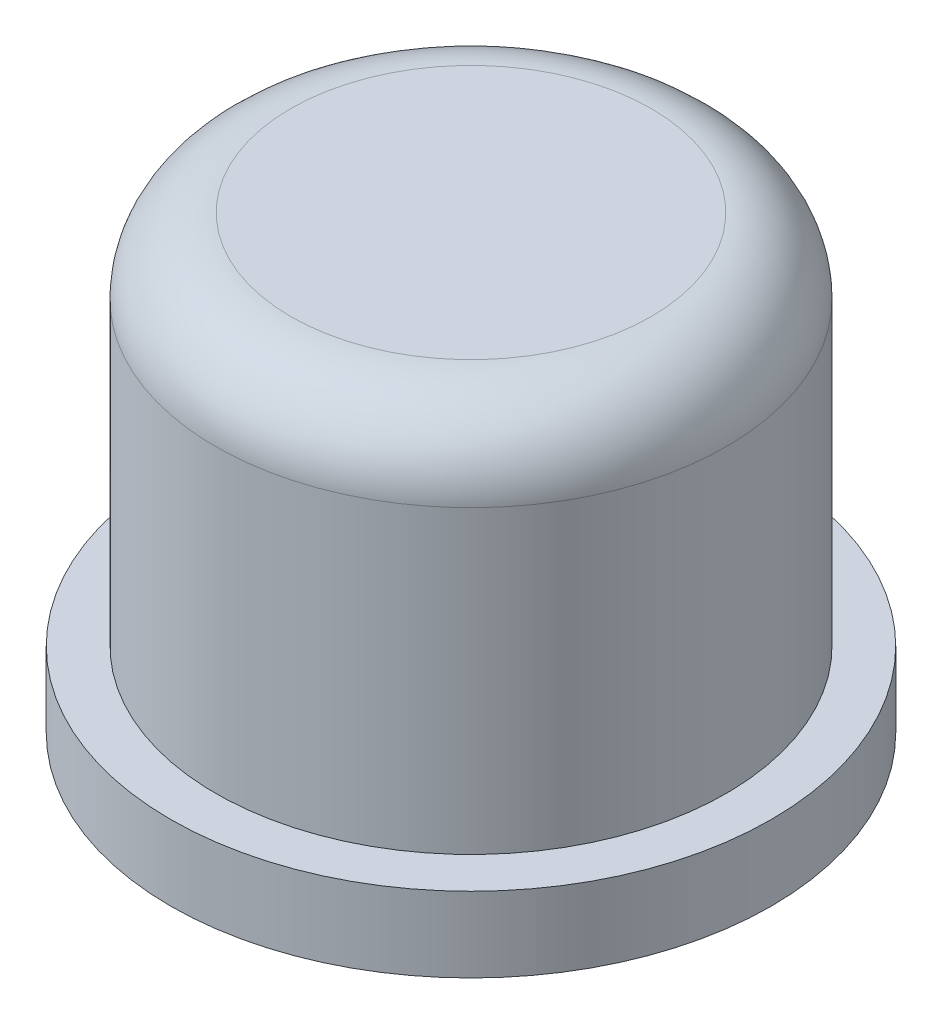
ISO-10303-21;
HEADER;
FILE_DESCRIPTION(('STEP AP214'),'2;1');
FILE_NAME('part.step','',(''),(''),'','','');
FILE_SCHEMA(('AUTOMOTIVE_DESIGN { 1 0 10303 214 1 1 1 1 }'));
ENDSEC;
DATA;
#1=APPLICATION_CONTEXT('core data for automotive mechanical design processes');
#2=APPLICATION_PROTOCOL_DEFINITION('international standard','automotive_design',2000,#1);
#3=PRODUCT_CONTEXT('',#1,'mechanical');
#4=PRODUCT('Part','Part','',(#3));
#5=PRODUCT_RELATED_PRODUCT_CATEGORY('part','',(#4));
#6=PRODUCT_DEFINITION_FORMATION('','',#4);
#7=PRODUCT_DEFINITION_CONTEXT('part definition',#1,'design');
#8=PRODUCT_DEFINITION('design','',#6,#7);
#9=PRODUCT_DEFINITION_SHAPE('','',#8);
#10=(LENGTH_UNIT() NAMED_UNIT(*) SI_UNIT(.MILLI.,.METRE.));
#11=(NAMED_UNIT(*) PLANE_ANGLE_UNIT() SI_UNIT($,.RADIAN.));
#12=(NAMED_UNIT(*) SI_UNIT($,.STERADIAN.) SOLID_ANGLE_UNIT());
#13=UNCERTAINTY_MEASURE_WITH_UNIT(LENGTH_MEASURE(1.E-05),#10,'distance_accuracy_value','');
#14=(GEOMETRIC_REPRESENTATION_CONTEXT(3) GLOBAL_UNCERTAINTY_ASSIGNED_CONTEXT((#13)) GLOBAL_UNIT_ASSIGNED_CONTEXT((#10,
#11,#12)) REPRESENTATION_CONTEXT('',''));
#15=CARTESIAN_POINT('',(0.,0.,0.));
#16=DIRECTION('',(0.,0.,1.));
#17=DIRECTION('',(1.,0.,0.));
#18=AXIS2_PLACEMENT_3D('',#15,#16,#17);
#19=CARTESIAN_POINT('',(0.,6.,0.));
#20=DIRECTION('',(0.,-1.,0.));
#21=DIRECTION('',(0.,0.,-1.));
#22=AXIS2_PLACEMENT_3D('',#19,#20,#21);
#23=PLANE('',#22);
#24=CARTESIAN_POINT('',(0.,6.,0.));
#25=DIRECTION('',(0.,-1.,0.));
#26=DIRECTION('',(0.,0.,-1.));
#27=AXIS2_PLACEMENT_3D('',#24,#25,#26);
#28=CIRCLE('',#27,2.4);
#29=CARTESIAN_POINT('',(0.,6.,-2.4));
#30=VERTEX_POINT('',#29);
#31=EDGE_CURVE('E10',#30,#30,#28,.F.);
#32=ORIENTED_EDGE('',*,*,#31,.T.);
#33=EDGE_LOOP('',(#32));
#34=FACE_BOUND('',#33,.T.);
#35=ADVANCED_FACE('F37',(#34),#23,.F.);
#36=CARTESIAN_POINT('',(0.,3.,0.));
#37=DIRECTION('',(0.,-1.,0.));
#38=DIRECTION('',(0.,0.,-1.));
#39=AXIS2_PLACEMENT_3D('',#36,#37,#38);
#40=CYLINDRICAL_SURFACE('',#39,3.4);
#41=CARTESIAN_POINT('',(0.,5.,0.));
#42=DIRECTION('',(0.,-1.,0.));
#43=DIRECTION('',(0.,0.,-1.));
#44=AXIS2_PLACEMENT_3D('',#41,#42,#43);
#45=CIRCLE('',#44,3.4);
#46=CARTESIAN_POINT('',(0.,5.,-3.4));
#47=VERTEX_POINT('',#46);
#48=EDGE_CURVE('E45',#47,#47,#45,.T.);
#49=ORIENTED_EDGE('',*,*,#48,.T.);
#50=EDGE_LOOP('',(#49));
#51=FACE_BOUND('',#50,.T.);
#52=CARTESIAN_POINT('',(0.,1.,0.));
#53=DIRECTION('',(0.,-1.,0.));
#54=DIRECTION('',(0.,0.,-1.));
#55=AXIS2_PLACEMENT_3D('',#52,#53,#54);
#56=CIRCLE('',#55,3.4);
#57=CARTESIAN_POINT('',(0.,1.,-3.4));
#58=VERTEX_POINT('',#57);
#59=EDGE_CURVE('E50',#58,#58,#56,.T.);
#60=ORIENTED_EDGE('',*,*,#59,.F.);
#61=EDGE_LOOP('',(#60));
#62=FACE_BOUND('',#61,.T.);
#63=ADVANCED_FACE('F97',(#51,#62),#40,.T.);
#64=CARTESIAN_POINT('',(-3.4,1.,0.));
#65=DIRECTION('',(0.,-1.,0.));
#66=DIRECTION('',(0.,0.,-1.));
#67=AXIS2_PLACEMENT_3D('',#64,#65,#66);
#68=PLANE('',#67);
#69=CARTESIAN_POINT('',(0.,1.,0.));
#70=DIRECTION('',(0.,-1.,0.));
#71=DIRECTION('',(0.,0.,-1.));
#72=AXIS2_PLACEMENT_3D('',#69,#70,#71);
#73=CIRCLE('',#72,4.);
#74=CARTESIAN_POINT('',(0.,1.,-4.));
#75=VERTEX_POINT('',#74);
#76=EDGE_CURVE('E55',#75,#75,#73,.T.);
#77=ORIENTED_EDGE('',*,*,#76,.F.);
#78=EDGE_LOOP('',(#77));
#79=FACE_BOUND('',#78,.T.);
#80=ORIENTED_EDGE('',*,*,#59,.T.);
#81=EDGE_LOOP('',(#80));
#82=FACE_BOUND('',#81,.T.);
#83=ADVANCED_FACE('F91',(#79,#82),#68,.F.);
#84=CARTESIAN_POINT('',(0.,3.,0.));
#85=DIRECTION('',(0.,-1.,0.));
#86=DIRECTION('',(0.,0.,-1.));
#87=AXIS2_PLACEMENT_3D('',#84,#85,#86);
#88=CYLINDRICAL_SURFACE('',#87,4.);
#89=CARTESIAN_POINT('',(0.,0.,0.));
#90=DIRECTION('',(0.,-1.,0.));
#91=DIRECTION('',(0.,0.,-1.));
#92=AXIS2_PLACEMENT_3D('',#89,#90,#91);
#93=CIRCLE('',#92,4.);
#94=CARTESIAN_POINT('',(0.,0.,-4.));
#95=VERTEX_POINT('',#94);
#96=EDGE_CURVE('E61',#95,#95,#93,.T.);
#97=ORIENTED_EDGE('',*,*,#96,.F.);
#98=EDGE_LOOP('',(#97));
#99=FACE_BOUND('',#98,.T.);
#100=ORIENTED_EDGE('',*,*,#76,.T.);
#101=EDGE_LOOP('',(#100));
#102=FACE_BOUND('',#101,.T.);
#103=ADVANCED_FACE('F85',(#99,#102),#88,.T.);
#104=CARTESIAN_POINT('',(-4.,0.,0.));
#105=DIRECTION('',(0.,1.,0.));
#106=DIRECTION('',(0.,0.,1.));
#107=AXIS2_PLACEMENT_3D('',#104,#105,#106);
#108=PLANE('',#107);
#109=CARTESIAN_POINT('',(0.,0.,0.));
#110=DIRECTION('',(0.,-1.,0.));
#111=DIRECTION('',(0.,0.,-1.));
#112=AXIS2_PLACEMENT_3D('',#109,#110,#111);
#113=CIRCLE('',#112,2.25);
#114=CARTESIAN_POINT('',(0.,0.,-2.25));
#115=VERTEX_POINT('',#114);
#116=EDGE_CURVE('E65',#115,#115,#113,.T.);
#117=ORIENTED_EDGE('',*,*,#116,.F.);
#118=EDGE_LOOP('',(#117));
#119=FACE_BOUND('',#118,.T.);
#120=ORIENTED_EDGE('',*,*,#96,.T.);
#121=EDGE_LOOP('',(#120));
#122=FACE_BOUND('',#121,.T.);
#123=ADVANCED_FACE('F79',(#119,#122),#108,.F.);
#124=CARTESIAN_POINT('',(0.,3.,0.));
#125=DIRECTION('',(0.,-1.,0.));
#126=DIRECTION('',(0.,0.,-1.));
#127=AXIS2_PLACEMENT_3D('',#124,#125,#126);
#128=CYLINDRICAL_SURFACE('',#127,2.25);
#129=CARTESIAN_POINT('',(0.,3.,0.));
#130=DIRECTION('',(0.,-1.,0.));
#131=DIRECTION('',(0.,0.,-1.));
#132=AXIS2_PLACEMENT_3D('',#129,#130,#131);
#133=CIRCLE('',#132,2.25);
#134=CARTESIAN_POINT('',(0.,3.,-2.25));
#135=VERTEX_POINT('',#134);
#136=EDGE_CURVE('E69',#135,#135,#133,.T.);
#137=ORIENTED_EDGE('',*,*,#136,.F.);
#138=EDGE_LOOP('',(#137));
#139=FACE_BOUND('',#138,.T.);
#140=ORIENTED_EDGE('',*,*,#116,.T.);
#141=EDGE_LOOP('',(#140));
#142=FACE_BOUND('',#141,.T.);
#143=ADVANCED_FACE('F76',(#139,#142),#128,.F.);
#144=CARTESIAN_POINT('',(-2.25,3.,0.));
#145=DIRECTION('',(0.,1.,0.));
#146=DIRECTION('',(0.,0.,1.));
#147=AXIS2_PLACEMENT_3D('',#144,#145,#146);
#148=PLANE('',#147);
#149=ORIENTED_EDGE('',*,*,#136,.T.);
#150=EDGE_LOOP('',(#149));
#151=FACE_BOUND('',#150,.T.);
#152=ADVANCED_FACE('F74',(#151),#148,.F.);
#153=CARTESIAN_POINT('',(0.,5.,0.));
#154=DIRECTION('',(0.,-1.,0.));
#155=DIRECTION('',(0.,0.,-1.));
#156=AXIS2_PLACEMENT_3D('',#153,#154,#155);
#157=TOROIDAL_SURFACE('',#156,2.4,1.);
#158=ORIENTED_EDGE('',*,*,#31,.F.);
#159=EDGE_LOOP('',(#158));
#160=FACE_BOUND('',#159,.T.);
#161=ORIENTED_EDGE('',*,*,#48,.F.);
#162=EDGE_LOOP('',(#161));
#163=FACE_BOUND('',#162,.T.);
#164=ADVANCED_FACE('F39',(#160,#163),#157,.T.);
#165=CLOSED_SHELL('',(#35,#63,#83,#103,#123,#143,#152,#164));
#166=MANIFOLD_SOLID_BREP('B2',#165);
#167=ADVANCED_BREP_SHAPE_REPRESENTATION('',(#18,#166),#14);
#168=SHAPE_DEFINITION_REPRESENTATION(#9,#167);
ENDSEC;
END-ISO-10303-21;
